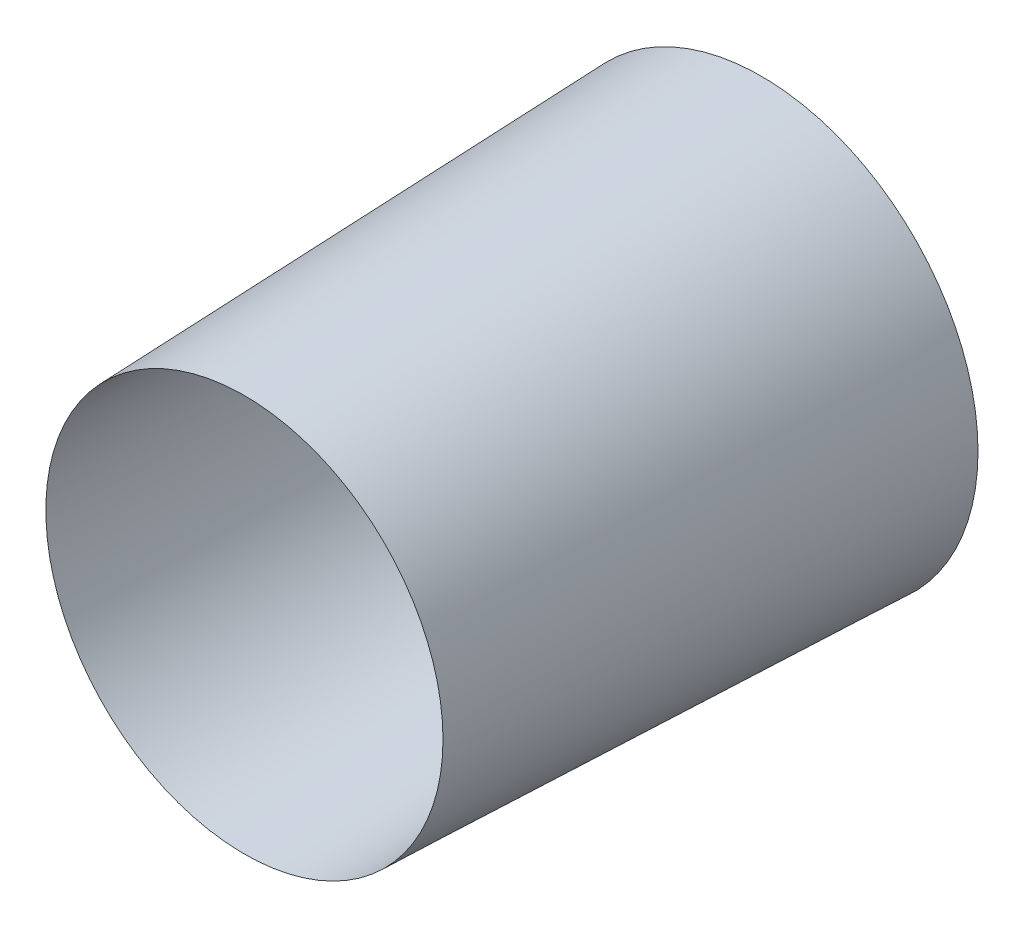
ISO-10303-21;
HEADER;
FILE_DESCRIPTION(('STEP AP214'),'2;1');
FILE_NAME('part.step','',(''),(''),'','','');
FILE_SCHEMA(('AUTOMOTIVE_DESIGN { 1 0 10303 214 1 1 1 1 }'));
ENDSEC;
DATA;
#1=APPLICATION_CONTEXT('core data for automotive mechanical design processes');
#2=APPLICATION_PROTOCOL_DEFINITION('international standard','automotive_design',2000,#1);
#3=PRODUCT_CONTEXT('',#1,'mechanical');
#4=PRODUCT('Part','Part','',(#3));
#5=PRODUCT_RELATED_PRODUCT_CATEGORY('part','',(#4));
#6=PRODUCT_DEFINITION_FORMATION('','',#4);
#7=PRODUCT_DEFINITION_CONTEXT('part definition',#1,'design');
#8=PRODUCT_DEFINITION('design','',#6,#7);
#9=PRODUCT_DEFINITION_SHAPE('','',#8);
#10=(LENGTH_UNIT() NAMED_UNIT(*) SI_UNIT(.MILLI.,.METRE.));
#11=(NAMED_UNIT(*) PLANE_ANGLE_UNIT() SI_UNIT($,.RADIAN.));
#12=(NAMED_UNIT(*) SI_UNIT($,.STERADIAN.) SOLID_ANGLE_UNIT());
#13=UNCERTAINTY_MEASURE_WITH_UNIT(LENGTH_MEASURE(1.E-05),#10,'distance_accuracy_value','');
#14=(GEOMETRIC_REPRESENTATION_CONTEXT(3) GLOBAL_UNCERTAINTY_ASSIGNED_CONTEXT((#13)) GLOBAL_UNIT_ASSIGNED_CONTEXT((#10,
#11,#12)) REPRESENTATION_CONTEXT('',''));
#15=CARTESIAN_POINT('',(0.,0.,0.));
#16=DIRECTION('',(0.,0.,1.));
#17=DIRECTION('',(1.,0.,0.));
#18=AXIS2_PLACEMENT_3D('',#15,#16,#17);
#19=CARTESIAN_POINT('',(0.,0.,0.));
#20=DIRECTION('',(0.,0.,1.));
#21=DIRECTION('',(1.,0.,0.));
#22=AXIS2_PLACEMENT_3D('',#19,#20,#21);
#23=CONICAL_SURFACE('',#22,10.,0.0349065850398866);
#24=CARTESIAN_POINT('',(0.,0.,0.));
#25=DIRECTION('',(0.,0.,1.));
#26=DIRECTION('',(1.,0.,0.));
#27=AXIS2_PLACEMENT_3D('',#24,#25,#26);
#28=CIRCLE('',#27,10.);
#29=CARTESIAN_POINT('',(10.,0.,0.));
#30=VERTEX_POINT('',#29);
#31=EDGE_CURVE('E55',#30,#30,#28,.T.);
#32=ORIENTED_EDGE('',*,*,#31,.F.);
#33=EDGE_LOOP('',(#32));
#34=FACE_BOUND('',#33,.T.);
#35=CARTESIAN_POINT('',(0.,0.,28.6362532829156));
#36=DIRECTION('',(0.,0.,1.));
#37=DIRECTION('',(1.,0.,0.));
#38=AXIS2_PLACEMENT_3D('',#35,#36,#37);
#39=CIRCLE('',#38,11.);
#40=CARTESIAN_POINT('',(11.,0.,28.6362532829156));
#41=VERTEX_POINT('',#40);
#42=EDGE_CURVE('E11',#41,#41,#39,.T.);
#43=ORIENTED_EDGE('',*,*,#42,.T.);
#44=EDGE_LOOP('',(#43));
#45=FACE_BOUND('',#44,.T.);
#46=ADVANCED_FACE('F43',(#34,#45),#23,.F.);
#47=CARTESIAN_POINT('',(0.,0.,0.));
#48=DIRECTION('',(0.,0.,1.));
#49=DIRECTION('',(1.,0.,0.));
#50=AXIS2_PLACEMENT_3D('',#47,#48,#49);
#51=PLANE('',#50);
#52=CARTESIAN_POINT('',(0.,0.,0.));
#53=DIRECTION('',(0.,0.,1.));
#54=DIRECTION('',(1.,0.,0.));
#55=AXIS2_PLACEMENT_3D('',#52,#53,#54);
#56=CIRCLE('',#55,12.);
#57=CARTESIAN_POINT('',(12.,0.,0.));
#58=VERTEX_POINT('',#57);
#59=EDGE_CURVE('E50',#58,#58,#56,.T.);
#60=ORIENTED_EDGE('',*,*,#59,.F.);
#61=EDGE_LOOP('',(#60));
#62=FACE_BOUND('',#61,.T.);
#63=ORIENTED_EDGE('',*,*,#31,.T.);
#64=EDGE_LOOP('',(#63));
#65=FACE_BOUND('',#64,.T.);
#66=ADVANCED_FACE('F63',(#62,#65),#51,.F.);
#67=CARTESIAN_POINT('',(0.,0.,0.));
#68=DIRECTION('',(0.,0.,-1.));
#69=DIRECTION('',(1.,0.,0.));
#70=AXIS2_PLACEMENT_3D('',#67,#68,#69);
#71=CONICAL_SURFACE('',#70,12.,0.0349065850398866);
#72=ORIENTED_EDGE('',*,*,#42,.F.);
#73=EDGE_LOOP('',(#72));
#74=FACE_BOUND('',#73,.T.);
#75=ORIENTED_EDGE('',*,*,#59,.T.);
#76=EDGE_LOOP('',(#75));
#77=FACE_BOUND('',#76,.T.);
#78=ADVANCED_FACE('F69',(#74,#77),#71,.T.);
#79=CLOSED_SHELL('',(#46,#66,#78));
#80=MANIFOLD_SOLID_BREP('B2',#79);
#81=ADVANCED_BREP_SHAPE_REPRESENTATION('',(#18,#80),#14);
#82=SHAPE_DEFINITION_REPRESENTATION(#9,#81);
ENDSEC;
END-ISO-10303-21;
